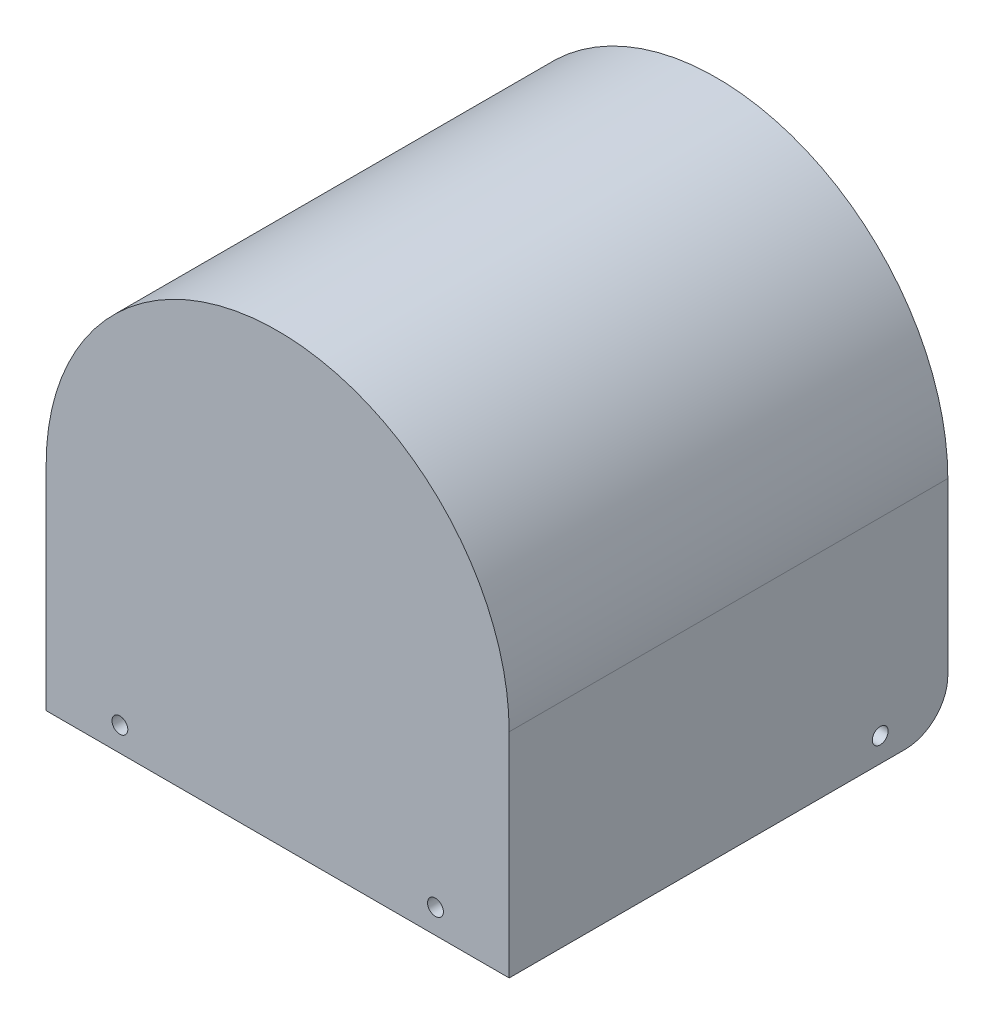
ISO-10303-21;
HEADER;
FILE_DESCRIPTION(('STEP AP214'),'2;1');
FILE_NAME('part.step','',(''),(''),'','','');
FILE_SCHEMA(('AUTOMOTIVE_DESIGN { 1 0 10303 214 1 1 1 1 }'));
ENDSEC;
DATA;
#1=APPLICATION_CONTEXT('core data for automotive mechanical design processes');
#2=APPLICATION_PROTOCOL_DEFINITION('international standard','automotive_design',2000,#1);
#3=PRODUCT_CONTEXT('',#1,'mechanical');
#4=PRODUCT('Part','Part','',(#3));
#5=PRODUCT_RELATED_PRODUCT_CATEGORY('part','',(#4));
#6=PRODUCT_DEFINITION_FORMATION('','',#4);
#7=PRODUCT_DEFINITION_CONTEXT('part definition',#1,'design');
#8=PRODUCT_DEFINITION('design','',#6,#7);
#9=PRODUCT_DEFINITION_SHAPE('','',#8);
#10=(LENGTH_UNIT() NAMED_UNIT(*) SI_UNIT(.MILLI.,.METRE.));
#11=(NAMED_UNIT(*) PLANE_ANGLE_UNIT() SI_UNIT($,.RADIAN.));
#12=(NAMED_UNIT(*) SI_UNIT($,.STERADIAN.) SOLID_ANGLE_UNIT());
#13=UNCERTAINTY_MEASURE_WITH_UNIT(LENGTH_MEASURE(1.E-05),#10,'distance_accuracy_value','');
#14=(GEOMETRIC_REPRESENTATION_CONTEXT(3) GLOBAL_UNCERTAINTY_ASSIGNED_CONTEXT((#13)) GLOBAL_UNIT_ASSIGNED_CONTEXT((#10,
#11,#12)) REPRESENTATION_CONTEXT('',''));
#15=CARTESIAN_POINT('',(0.,0.,0.));
#16=DIRECTION('',(0.,0.,1.));
#17=DIRECTION('',(1.,0.,0.));
#18=AXIS2_PLACEMENT_3D('',#15,#16,#17);
#19=CARTESIAN_POINT('',(0.,0.,72.));
#20=DIRECTION('',(0.,0.,-1.));
#21=DIRECTION('',(-1.,0.,0.));
#22=AXIS2_PLACEMENT_3D('',#19,#20,#21);
#23=CYLINDRICAL_SURFACE('',#22,36.);
#24=DIRECTION('',(0.,0.,-1.));
#25=VECTOR('',#24,1.);
#26=CARTESIAN_POINT('',(36.,0.,72.));
#27=LINE('',#26,#25);
#28=CARTESIAN_POINT('',(36.,0.,70.));
#29=VERTEX_POINT('',#28);
#30=CARTESIAN_POINT('',(36.,0.,0.));
#31=VERTEX_POINT('',#30);
#32=EDGE_CURVE('E126',#29,#31,#27,.T.);
#33=ORIENTED_EDGE('',*,*,#32,.F.);
#34=CARTESIAN_POINT('',(0.,0.,70.));
#35=DIRECTION('',(0.,0.,1.));
#36=DIRECTION('',(1.,0.,0.));
#37=AXIS2_PLACEMENT_3D('',#34,#35,#36);
#38=CIRCLE('',#37,36.);
#39=CARTESIAN_POINT('',(-36.,0.,70.));
#40=VERTEX_POINT('',#39);
#41=EDGE_CURVE('E111',#29,#40,#38,.T.);
#42=ORIENTED_EDGE('',*,*,#41,.T.);
#43=DIRECTION('',(0.,0.,-1.));
#44=VECTOR('',#43,1.);
#45=CARTESIAN_POINT('',(-36.,0.,72.));
#46=LINE('',#45,#44);
#47=CARTESIAN_POINT('',(-36.,0.,0.));
#48=VERTEX_POINT('',#47);
#49=EDGE_CURVE('E198',#40,#48,#46,.T.);
#50=ORIENTED_EDGE('',*,*,#49,.T.);
#51=CARTESIAN_POINT('',(0.,0.,0.));
#52=DIRECTION('',(0.,0.,-1.));
#53=DIRECTION('',(-1.,0.,0.));
#54=AXIS2_PLACEMENT_3D('',#51,#52,#53);
#55=CIRCLE('',#54,36.);
#56=EDGE_CURVE('E132',#48,#31,#55,.T.);
#57=ORIENTED_EDGE('',*,*,#56,.T.);
#58=EDGE_LOOP('',(#33,#42,#50,#57));
#59=FACE_BOUND('',#58,.T.);
#60=ADVANCED_FACE('F35',(#59),#23,.F.);
#61=CARTESIAN_POINT('',(36.,0.,72.));
#62=DIRECTION('',(1.,0.,0.));
#63=DIRECTION('',(0.,1.,0.));
#64=AXIS2_PLACEMENT_3D('',#61,#62,#63);
#65=PLANE('',#64);
#66=CARTESIAN_POINT('',(36.,-31.,11.1));
#67=DIRECTION('',(1.,0.,0.));
#68=DIRECTION('',(0.,1.,0.));
#69=AXIS2_PLACEMENT_3D('',#66,#67,#68);
#70=CIRCLE('',#69,1.3);
#71=CARTESIAN_POINT('',(36.,-29.7,11.1));
#72=VERTEX_POINT('',#71);
#73=EDGE_CURVE('E150',#72,#72,#70,.T.);
#74=ORIENTED_EDGE('',*,*,#73,.T.);
#75=EDGE_LOOP('',(#74));
#76=FACE_BOUND('',#75,.T.);
#77=DIRECTION('',(0.,-1.,0.));
#78=VECTOR('',#77,1.);
#79=CARTESIAN_POINT('',(36.,0.,0.));
#80=LINE('',#79,#78);
#81=CARTESIAN_POINT('',(36.,-28.,0.));
#82=VERTEX_POINT('',#81);
#83=EDGE_CURVE('E211',#31,#82,#80,.T.);
#84=ORIENTED_EDGE('',*,*,#83,.T.);
#85=CARTESIAN_POINT('',(36.,-28.,7.00000000000001));
#86=DIRECTION('',(1.,0.,0.));
#87=DIRECTION('',(0.,1.,0.));
#88=AXIS2_PLACEMENT_3D('',#85,#86,#87);
#89=CIRCLE('',#88,7.);
#90=CARTESIAN_POINT('',(36.,-35.,7.00000000000001));
#91=VERTEX_POINT('',#90);
#92=EDGE_CURVE('E11',#82,#91,#89,.F.);
#93=ORIENTED_EDGE('',*,*,#92,.T.);
#94=DIRECTION('',(0.,0.,-1.));
#95=VECTOR('',#94,1.);
#96=CARTESIAN_POINT('',(36.,-35.,72.));
#97=LINE('',#96,#95);
#98=CARTESIAN_POINT('',(36.,-35.,70.));
#99=VERTEX_POINT('',#98);
#100=EDGE_CURVE('E128',#99,#91,#97,.T.);
#101=ORIENTED_EDGE('',*,*,#100,.F.);
#102=DIRECTION('',(0.,1.,0.));
#103=VECTOR('',#102,1.);
#104=CARTESIAN_POINT('',(36.,-107.027772421476,70.));
#105=LINE('',#104,#103);
#106=EDGE_CURVE('E114',#99,#29,#105,.T.);
#107=ORIENTED_EDGE('',*,*,#106,.T.);
#108=ORIENTED_EDGE('',*,*,#32,.T.);
#109=EDGE_LOOP('',(#84,#93,#101,#107,#108));
#110=FACE_BOUND('',#109,.T.);
#111=ADVANCED_FACE('F125',(#76,#110),#65,.F.);
#112=CARTESIAN_POINT('',(38.,0.,72.));
#113=DIRECTION('',(-1.,0.,0.));
#114=DIRECTION('',(0.,-1.,0.));
#115=AXIS2_PLACEMENT_3D('',#112,#113,#114);
#116=PLANE('',#115);
#117=CARTESIAN_POINT('',(38.,-31.,11.1));
#118=DIRECTION('',(1.,0.,0.));
#119=DIRECTION('',(0.,1.,0.));
#120=AXIS2_PLACEMENT_3D('',#117,#118,#119);
#121=CIRCLE('',#120,1.3);
#122=CARTESIAN_POINT('',(38.,-29.7,11.1));
#123=VERTEX_POINT('',#122);
#124=EDGE_CURVE('E237',#123,#123,#121,.T.);
#125=ORIENTED_EDGE('',*,*,#124,.F.);
#126=EDGE_LOOP('',(#125));
#127=FACE_BOUND('',#126,.T.);
#128=DIRECTION('',(0.,0.,-1.));
#129=VECTOR('',#128,1.);
#130=CARTESIAN_POINT('',(38.,-35.,72.));
#131=LINE('',#130,#129);
#132=CARTESIAN_POINT('',(38.,-35.,72.));
#133=VERTEX_POINT('',#132);
#134=CARTESIAN_POINT('',(38.,-35.,7.00000000000001));
#135=VERTEX_POINT('',#134);
#136=EDGE_CURVE('E138',#133,#135,#131,.T.);
#137=ORIENTED_EDGE('',*,*,#136,.T.);
#138=CARTESIAN_POINT('',(38.,-28.,7.00000000000001));
#139=DIRECTION('',(-1.,0.,0.));
#140=DIRECTION('',(0.,-1.,0.));
#141=AXIS2_PLACEMENT_3D('',#138,#139,#140);
#142=CIRCLE('',#141,7.);
#143=CARTESIAN_POINT('',(38.,-28.,0.));
#144=VERTEX_POINT('',#143);
#145=EDGE_CURVE('E43',#135,#144,#142,.F.);
#146=ORIENTED_EDGE('',*,*,#145,.T.);
#147=DIRECTION('',(0.,1.,0.));
#148=VECTOR('',#147,1.);
#149=CARTESIAN_POINT('',(38.,0.,0.));
#150=LINE('',#149,#148);
#151=CARTESIAN_POINT('',(38.,0.,0.));
#152=VERTEX_POINT('',#151);
#153=EDGE_CURVE('E212',#144,#152,#150,.T.);
#154=ORIENTED_EDGE('',*,*,#153,.T.);
#155=DIRECTION('',(0.,0.,-1.));
#156=VECTOR('',#155,1.);
#157=CARTESIAN_POINT('',(38.,0.,72.));
#158=LINE('',#157,#156);
#159=CARTESIAN_POINT('',(38.,0.,72.));
#160=VERTEX_POINT('',#159);
#161=EDGE_CURVE('E203',#160,#152,#158,.T.);
#162=ORIENTED_EDGE('',*,*,#161,.F.);
#163=DIRECTION('',(0.,1.,0.));
#164=VECTOR('',#163,1.);
#165=CARTESIAN_POINT('',(38.,0.,72.));
#166=LINE('',#165,#164);
#167=EDGE_CURVE('E192',#133,#160,#166,.T.);
#168=ORIENTED_EDGE('',*,*,#167,.F.);
#169=EDGE_LOOP('',(#137,#146,#154,#162,#168));
#170=FACE_BOUND('',#169,.T.);
#171=ADVANCED_FACE('F206',(#127,#170),#116,.F.);
#172=CARTESIAN_POINT('',(0.,0.,72.));
#173=DIRECTION('',(0.,0.,-1.));
#174=DIRECTION('',(-1.,0.,0.));
#175=AXIS2_PLACEMENT_3D('',#172,#173,#174);
#176=CYLINDRICAL_SURFACE('',#175,38.);
#177=CARTESIAN_POINT('',(0.,0.,0.));
#178=DIRECTION('',(0.,0.,1.));
#179=DIRECTION('',(-1.,0.,0.));
#180=AXIS2_PLACEMENT_3D('',#177,#178,#179);
#181=CIRCLE('',#180,38.);
#182=CARTESIAN_POINT('',(-38.,0.,0.));
#183=VERTEX_POINT('',#182);
#184=EDGE_CURVE('E194',#152,#183,#181,.T.);
#185=ORIENTED_EDGE('',*,*,#184,.T.);
#186=DIRECTION('',(0.,0.,-1.));
#187=VECTOR('',#186,1.);
#188=CARTESIAN_POINT('',(-38.,0.,72.));
#189=LINE('',#188,#187);
#190=CARTESIAN_POINT('',(-38.,0.,72.));
#191=VERTEX_POINT('',#190);
#192=EDGE_CURVE('E182',#191,#183,#189,.T.);
#193=ORIENTED_EDGE('',*,*,#192,.F.);
#194=CARTESIAN_POINT('',(0.,0.,72.));
#195=DIRECTION('',(0.,0.,1.));
#196=DIRECTION('',(-1.,0.,0.));
#197=AXIS2_PLACEMENT_3D('',#194,#195,#196);
#198=CIRCLE('',#197,38.);
#199=EDGE_CURVE('E224',#160,#191,#198,.T.);
#200=ORIENTED_EDGE('',*,*,#199,.F.);
#201=ORIENTED_EDGE('',*,*,#161,.T.);
#202=EDGE_LOOP('',(#185,#193,#200,#201));
#203=FACE_BOUND('',#202,.T.);
#204=ADVANCED_FACE('F221',(#203),#176,.T.);
#205=CARTESIAN_POINT('',(-38.,0.,72.));
#206=DIRECTION('',(1.,0.,0.));
#207=DIRECTION('',(0.,1.,0.));
#208=AXIS2_PLACEMENT_3D('',#205,#206,#207);
#209=PLANE('',#208);
#210=CARTESIAN_POINT('',(-38.,-31.,11.1));
#211=DIRECTION('',(1.,0.,0.));
#212=DIRECTION('',(0.,1.,0.));
#213=AXIS2_PLACEMENT_3D('',#210,#211,#212);
#214=CIRCLE('',#213,1.3);
#215=CARTESIAN_POINT('',(-38.,-29.7,11.1));
#216=VERTEX_POINT('',#215);
#217=EDGE_CURVE('E151',#216,#216,#214,.T.);
#218=ORIENTED_EDGE('',*,*,#217,.T.);
#219=EDGE_LOOP('',(#218));
#220=FACE_BOUND('',#219,.T.);
#221=DIRECTION('',(0.,-1.,0.));
#222=VECTOR('',#221,1.);
#223=CARTESIAN_POINT('',(-38.,0.,0.));
#224=LINE('',#223,#222);
#225=CARTESIAN_POINT('',(-38.,-28.,0.));
#226=VERTEX_POINT('',#225);
#227=EDGE_CURVE('E171',#183,#226,#224,.T.);
#228=ORIENTED_EDGE('',*,*,#227,.T.);
#229=CARTESIAN_POINT('',(-38.,-28.,7.00000000000001));
#230=DIRECTION('',(1.,0.,0.));
#231=DIRECTION('',(0.,1.,0.));
#232=AXIS2_PLACEMENT_3D('',#229,#230,#231);
#233=CIRCLE('',#232,7.);
#234=CARTESIAN_POINT('',(-38.,-35.,7.00000000000001));
#235=VERTEX_POINT('',#234);
#236=EDGE_CURVE('E160',#226,#235,#233,.F.);
#237=ORIENTED_EDGE('',*,*,#236,.T.);
#238=DIRECTION('',(0.,0.,-1.));
#239=VECTOR('',#238,1.);
#240=CARTESIAN_POINT('',(-38.,-35.,72.));
#241=LINE('',#240,#239);
#242=CARTESIAN_POINT('',(-38.,-35.,72.));
#243=VERTEX_POINT('',#242);
#244=EDGE_CURVE('E168',#243,#235,#241,.T.);
#245=ORIENTED_EDGE('',*,*,#244,.F.);
#246=DIRECTION('',(0.,-1.,0.));
#247=VECTOR('',#246,1.);
#248=CARTESIAN_POINT('',(-38.,0.,72.));
#249=LINE('',#248,#247);
#250=EDGE_CURVE('E200',#191,#243,#249,.T.);
#251=ORIENTED_EDGE('',*,*,#250,.F.);
#252=ORIENTED_EDGE('',*,*,#192,.T.);
#253=EDGE_LOOP('',(#228,#237,#245,#251,#252));
#254=FACE_BOUND('',#253,.T.);
#255=ADVANCED_FACE('F166',(#220,#254),#209,.F.);
#256=CARTESIAN_POINT('',(-38.,-35.,72.));
#257=DIRECTION('',(0.,1.,0.));
#258=DIRECTION('',(0.,0.,1.));
#259=AXIS2_PLACEMENT_3D('',#256,#257,#258);
#260=PLANE('',#259);
#261=ORIENTED_EDGE('',*,*,#244,.T.);
#262=DIRECTION('',(1.,0.,0.));
#263=VECTOR('',#262,1.);
#264=CARTESIAN_POINT('',(-36.,-35.,7.00000000000001));
#265=LINE('',#264,#263);
#266=CARTESIAN_POINT('',(-36.,-35.,7.00000000000001));
#267=VERTEX_POINT('',#266);
#268=EDGE_CURVE('E136',#235,#267,#265,.T.);
#269=ORIENTED_EDGE('',*,*,#268,.T.);
#270=DIRECTION('',(0.,0.,-1.));
#271=VECTOR('',#270,1.);
#272=CARTESIAN_POINT('',(-36.,-35.,72.));
#273=LINE('',#272,#271);
#274=CARTESIAN_POINT('',(-36.,-35.,70.));
#275=VERTEX_POINT('',#274);
#276=EDGE_CURVE('E183',#275,#267,#273,.T.);
#277=ORIENTED_EDGE('',*,*,#276,.F.);
#278=DIRECTION('',(1.,0.,0.));
#279=VECTOR('',#278,1.);
#280=CARTESIAN_POINT('',(-36.,-35.,70.));
#281=LINE('',#280,#279);
#282=EDGE_CURVE('E215',#275,#99,#281,.T.);
#283=ORIENTED_EDGE('',*,*,#282,.T.);
#284=ORIENTED_EDGE('',*,*,#100,.T.);
#285=DIRECTION('',(1.,0.,0.));
#286=VECTOR('',#285,1.);
#287=CARTESIAN_POINT('',(38.,-35.,7.00000000000001));
#288=LINE('',#287,#286);
#289=EDGE_CURVE('E133',#91,#135,#288,.T.);
#290=ORIENTED_EDGE('',*,*,#289,.T.);
#291=ORIENTED_EDGE('',*,*,#136,.F.);
#292=DIRECTION('',(1.,0.,0.));
#293=VECTOR('',#292,1.);
#294=CARTESIAN_POINT('',(36.,-35.,72.));
#295=LINE('',#294,#293);
#296=EDGE_CURVE('E180',#243,#133,#295,.T.);
#297=ORIENTED_EDGE('',*,*,#296,.F.);
#298=EDGE_LOOP('',(#261,#269,#277,#283,#284,#290,#291,#297));
#299=FACE_BOUND('',#298,.T.);
#300=ADVANCED_FACE('F176',(#299),#260,.F.);
#301=CARTESIAN_POINT('',(-36.,0.,72.));
#302=DIRECTION('',(-1.,0.,0.));
#303=DIRECTION('',(0.,-1.,0.));
#304=AXIS2_PLACEMENT_3D('',#301,#302,#303);
#305=PLANE('',#304);
#306=CARTESIAN_POINT('',(-36.,-31.,11.1));
#307=DIRECTION('',(-1.,0.,0.));
#308=DIRECTION('',(0.,-1.,0.));
#309=AXIS2_PLACEMENT_3D('',#306,#307,#308);
#310=CIRCLE('',#309,1.3);
#311=CARTESIAN_POINT('',(-36.,-32.3,11.1));
#312=VERTEX_POINT('',#311);
#313=EDGE_CURVE('E148',#312,#312,#310,.T.);
#314=ORIENTED_EDGE('',*,*,#313,.T.);
#315=EDGE_LOOP('',(#314));
#316=FACE_BOUND('',#315,.T.);
#317=ORIENTED_EDGE('',*,*,#276,.T.);
#318=CARTESIAN_POINT('',(-36.,-28.,7.00000000000001));
#319=DIRECTION('',(-1.,0.,0.));
#320=DIRECTION('',(0.,-1.,0.));
#321=AXIS2_PLACEMENT_3D('',#318,#319,#320);
#322=CIRCLE('',#321,7.);
#323=CARTESIAN_POINT('',(-36.,-28.,0.));
#324=VERTEX_POINT('',#323);
#325=EDGE_CURVE('E155',#267,#324,#322,.F.);
#326=ORIENTED_EDGE('',*,*,#325,.T.);
#327=DIRECTION('',(0.,1.,0.));
#328=VECTOR('',#327,1.);
#329=CARTESIAN_POINT('',(-36.,0.,0.));
#330=LINE('',#329,#328);
#331=EDGE_CURVE('E189',#324,#48,#330,.T.);
#332=ORIENTED_EDGE('',*,*,#331,.T.);
#333=ORIENTED_EDGE('',*,*,#49,.F.);
#334=DIRECTION('',(0.,1.,0.));
#335=VECTOR('',#334,1.);
#336=CARTESIAN_POINT('',(-36.,-107.027772421476,70.));
#337=LINE('',#336,#335);
#338=EDGE_CURVE('E117',#275,#40,#337,.T.);
#339=ORIENTED_EDGE('',*,*,#338,.F.);
#340=EDGE_LOOP('',(#317,#326,#332,#333,#339));
#341=FACE_BOUND('',#340,.T.);
#342=ADVANCED_FACE('F188',(#316,#341),#305,.F.);
#343=CARTESIAN_POINT('',(0.,0.,72.));
#344=DIRECTION('',(0.,0.,-1.));
#345=DIRECTION('',(-1.,0.,0.));
#346=AXIS2_PLACEMENT_3D('',#343,#344,#345);
#347=PLANE('',#346);
#348=CARTESIAN_POINT('',(-25.9,-31.,72.));
#349=DIRECTION('',(0.,0.,1.));
#350=DIRECTION('',(1.,0.,0.));
#351=AXIS2_PLACEMENT_3D('',#348,#349,#350);
#352=CIRCLE('',#351,1.3);
#353=CARTESIAN_POINT('',(-24.6,-31.,72.));
#354=VERTEX_POINT('',#353);
#355=EDGE_CURVE('E145',#354,#354,#352,.T.);
#356=ORIENTED_EDGE('',*,*,#355,.F.);
#357=EDGE_LOOP('',(#356));
#358=FACE_BOUND('',#357,.T.);
#359=CARTESIAN_POINT('',(25.9,-31.,72.));
#360=DIRECTION('',(0.,0.,1.));
#361=DIRECTION('',(1.,0.,0.));
#362=AXIS2_PLACEMENT_3D('',#359,#360,#361);
#363=CIRCLE('',#362,1.3);
#364=CARTESIAN_POINT('',(27.2,-31.,72.));
#365=VERTEX_POINT('',#364);
#366=EDGE_CURVE('E230',#365,#365,#363,.T.);
#367=ORIENTED_EDGE('',*,*,#366,.F.);
#368=EDGE_LOOP('',(#367));
#369=FACE_BOUND('',#368,.T.);
#370=ORIENTED_EDGE('',*,*,#250,.T.);
#371=ORIENTED_EDGE('',*,*,#296,.T.);
#372=ORIENTED_EDGE('',*,*,#167,.T.);
#373=ORIENTED_EDGE('',*,*,#199,.T.);
#374=EDGE_LOOP('',(#370,#371,#372,#373));
#375=FACE_BOUND('',#374,.T.);
#376=ADVANCED_FACE('F253',(#358,#369,#375),#347,.F.);
#377=CARTESIAN_POINT('',(0.,0.,0.));
#378=DIRECTION('',(0.,0.,-1.));
#379=DIRECTION('',(-1.,0.,0.));
#380=AXIS2_PLACEMENT_3D('',#377,#378,#379);
#381=PLANE('',#380);
#382=ORIENTED_EDGE('',*,*,#331,.F.);
#383=DIRECTION('',(1.,0.,0.));
#384=VECTOR('',#383,1.);
#385=CARTESIAN_POINT('',(-38.,-28.,0.));
#386=LINE('',#385,#384);
#387=EDGE_CURVE('E158',#324,#226,#386,.F.);
#388=ORIENTED_EDGE('',*,*,#387,.T.);
#389=ORIENTED_EDGE('',*,*,#227,.F.);
#390=ORIENTED_EDGE('',*,*,#184,.F.);
#391=ORIENTED_EDGE('',*,*,#153,.F.);
#392=DIRECTION('',(1.,0.,0.));
#393=VECTOR('',#392,1.);
#394=CARTESIAN_POINT('',(36.,-28.,0.));
#395=LINE('',#394,#393);
#396=EDGE_CURVE('E50',#144,#82,#395,.F.);
#397=ORIENTED_EDGE('',*,*,#396,.T.);
#398=ORIENTED_EDGE('',*,*,#83,.F.);
#399=ORIENTED_EDGE('',*,*,#56,.F.);
#400=EDGE_LOOP('',(#382,#388,#389,#390,#391,#397,#398,#399));
#401=FACE_BOUND('',#400,.T.);
#402=ADVANCED_FACE('F190',(#401),#381,.T.);
#403=CARTESIAN_POINT('',(-36.,-107.027772421476,70.));
#404=DIRECTION('',(0.,0.,-1.));
#405=DIRECTION('',(-1.,0.,0.));
#406=AXIS2_PLACEMENT_3D('',#403,#404,#405);
#407=PLANE('',#406);
#408=CARTESIAN_POINT('',(-25.9,-31.,70.));
#409=DIRECTION('',(0.,0.,-1.));
#410=DIRECTION('',(-1.,0.,0.));
#411=AXIS2_PLACEMENT_3D('',#408,#409,#410);
#412=CIRCLE('',#411,1.3);
#413=CARTESIAN_POINT('',(-27.2,-31.,70.));
#414=VERTEX_POINT('',#413);
#415=EDGE_CURVE('E122',#414,#414,#412,.T.);
#416=ORIENTED_EDGE('',*,*,#415,.F.);
#417=EDGE_LOOP('',(#416));
#418=FACE_BOUND('',#417,.T.);
#419=CARTESIAN_POINT('',(25.9,-31.,70.));
#420=DIRECTION('',(0.,0.,-1.));
#421=DIRECTION('',(-1.,0.,0.));
#422=AXIS2_PLACEMENT_3D('',#419,#420,#421);
#423=CIRCLE('',#422,1.3);
#424=CARTESIAN_POINT('',(24.6,-31.,70.));
#425=VERTEX_POINT('',#424);
#426=EDGE_CURVE('E142',#425,#425,#423,.T.);
#427=ORIENTED_EDGE('',*,*,#426,.F.);
#428=EDGE_LOOP('',(#427));
#429=FACE_BOUND('',#428,.T.);
#430=ORIENTED_EDGE('',*,*,#282,.F.);
#431=ORIENTED_EDGE('',*,*,#338,.T.);
#432=ORIENTED_EDGE('',*,*,#41,.F.);
#433=ORIENTED_EDGE('',*,*,#106,.F.);
#434=EDGE_LOOP('',(#430,#431,#432,#433));
#435=FACE_BOUND('',#434,.T.);
#436=ADVANCED_FACE('F113',(#418,#429,#435),#407,.T.);
#437=CARTESIAN_POINT('',(25.9,-31.,62.));
#438=DIRECTION('',(0.,0.,1.));
#439=DIRECTION('',(1.,0.,0.));
#440=AXIS2_PLACEMENT_3D('',#437,#438,#439);
#441=CYLINDRICAL_SURFACE('',#440,1.3);
#442=ORIENTED_EDGE('',*,*,#426,.T.);
#443=EDGE_LOOP('',(#442));
#444=FACE_BOUND('',#443,.T.);
#445=ORIENTED_EDGE('',*,*,#366,.T.);
#446=EDGE_LOOP('',(#445));
#447=FACE_BOUND('',#446,.T.);
#448=ADVANCED_FACE('F283',(#444,#447),#441,.F.);
#449=CARTESIAN_POINT('',(-25.9,-31.,62.));
#450=DIRECTION('',(0.,0.,1.));
#451=DIRECTION('',(1.,0.,0.));
#452=AXIS2_PLACEMENT_3D('',#449,#450,#451);
#453=CYLINDRICAL_SURFACE('',#452,1.3);
#454=ORIENTED_EDGE('',*,*,#415,.T.);
#455=EDGE_LOOP('',(#454));
#456=FACE_BOUND('',#455,.T.);
#457=ORIENTED_EDGE('',*,*,#355,.T.);
#458=EDGE_LOOP('',(#457));
#459=FACE_BOUND('',#458,.T.);
#460=ADVANCED_FACE('F248',(#456,#459),#453,.F.);
#461=CARTESIAN_POINT('',(-38.,-31.,11.1));
#462=DIRECTION('',(1.,0.,0.));
#463=DIRECTION('',(0.,1.,0.));
#464=AXIS2_PLACEMENT_3D('',#461,#462,#463);
#465=CYLINDRICAL_SURFACE('',#464,1.3);
#466=ORIENTED_EDGE('',*,*,#217,.F.);
#467=EDGE_LOOP('',(#466));
#468=FACE_BOUND('',#467,.T.);
#469=ORIENTED_EDGE('',*,*,#313,.F.);
#470=EDGE_LOOP('',(#469));
#471=FACE_BOUND('',#470,.T.);
#472=ADVANCED_FACE('F244',(#468,#471),#465,.F.);
#473=ORIENTED_EDGE('',*,*,#124,.T.);
#474=EDGE_LOOP('',(#473));
#475=FACE_BOUND('',#474,.T.);
#476=ORIENTED_EDGE('',*,*,#73,.F.);
#477=EDGE_LOOP('',(#476));
#478=FACE_BOUND('',#477,.T.);
#479=ADVANCED_FACE('F247',(#475,#478),#465,.F.);
#480=CARTESIAN_POINT('',(-38.,-28.,7.00000000000001));
#481=DIRECTION('',(-1.,0.,0.));
#482=DIRECTION('',(0.,0.,1.));
#483=AXIS2_PLACEMENT_3D('',#480,#481,#482);
#484=CYLINDRICAL_SURFACE('',#483,7.);
#485=ORIENTED_EDGE('',*,*,#236,.F.);
#486=ORIENTED_EDGE('',*,*,#387,.F.);
#487=ORIENTED_EDGE('',*,*,#325,.F.);
#488=ORIENTED_EDGE('',*,*,#268,.F.);
#489=EDGE_LOOP('',(#485,#486,#487,#488));
#490=FACE_BOUND('',#489,.T.);
#491=ADVANCED_FACE('F185',(#490),#484,.T.);
#492=CARTESIAN_POINT('',(-38.,-28.,7.00000000000001));
#493=DIRECTION('',(-1.,0.,0.));
#494=DIRECTION('',(0.,0.,1.));
#495=AXIS2_PLACEMENT_3D('',#492,#493,#494);
#496=CYLINDRICAL_SURFACE('',#495,7.);
#497=ORIENTED_EDGE('',*,*,#92,.F.);
#498=ORIENTED_EDGE('',*,*,#396,.F.);
#499=ORIENTED_EDGE('',*,*,#145,.F.);
#500=ORIENTED_EDGE('',*,*,#289,.F.);
#501=EDGE_LOOP('',(#497,#498,#499,#500));
#502=FACE_BOUND('',#501,.T.);
#503=ADVANCED_FACE('F37',(#502),#496,.T.);
#504=CLOSED_SHELL('',(#60,#111,#171,#204,#255,#300,#342,#376,#402,#436,#448,#460,#472,#479,#491,#503));
#505=MANIFOLD_SOLID_BREP('B2',#504);
#506=ADVANCED_BREP_SHAPE_REPRESENTATION('',(#18,#505),#14);
#507=SHAPE_DEFINITION_REPRESENTATION(#9,#506);
ENDSEC;
END-ISO-10303-21;
